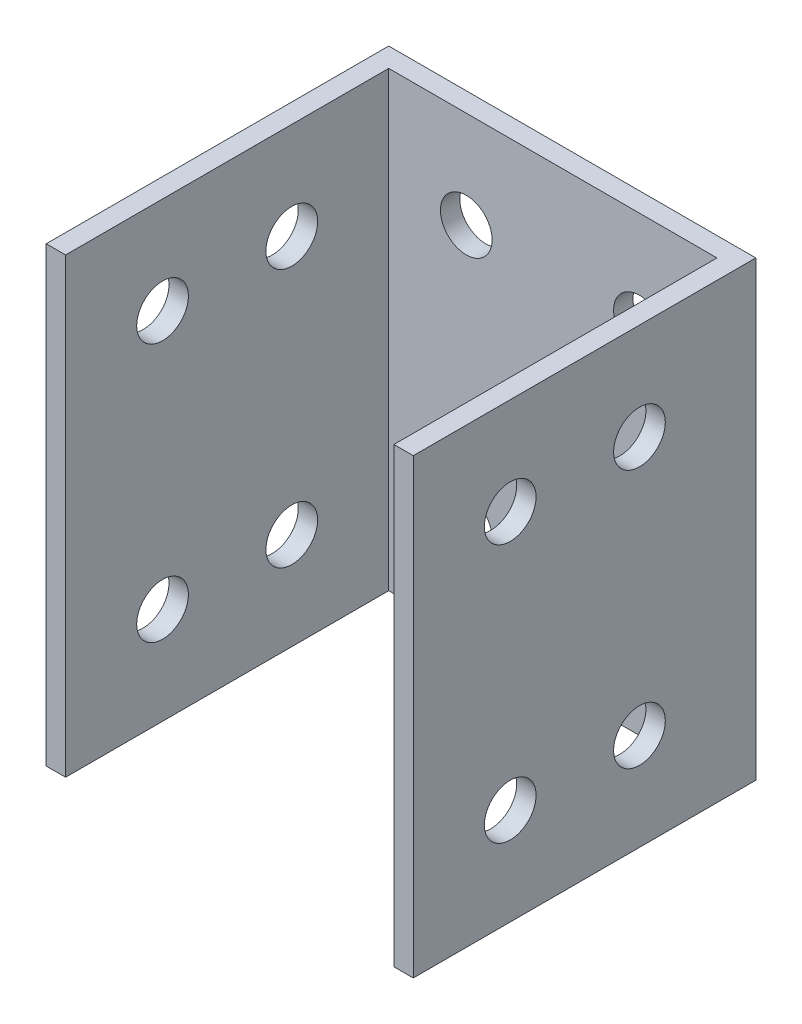
ISO-10303-21;
HEADER;
FILE_DESCRIPTION(('STEP AP214'),'2;1');
FILE_NAME('part.step','',(''),(''),'','','');
FILE_SCHEMA(('AUTOMOTIVE_DESIGN { 1 0 10303 214 1 1 1 1 }'));
ENDSEC;
DATA;
#1=APPLICATION_CONTEXT('core data for automotive mechanical design processes');
#2=APPLICATION_PROTOCOL_DEFINITION('international standard','automotive_design',2000,#1);
#3=PRODUCT_CONTEXT('',#1,'mechanical');
#4=PRODUCT('Part','Part','',(#3));
#5=PRODUCT_RELATED_PRODUCT_CATEGORY('part','',(#4));
#6=PRODUCT_DEFINITION_FORMATION('','',#4);
#7=PRODUCT_DEFINITION_CONTEXT('part definition',#1,'design');
#8=PRODUCT_DEFINITION('design','',#6,#7);
#9=PRODUCT_DEFINITION_SHAPE('','',#8);
#10=(LENGTH_UNIT() NAMED_UNIT(*) SI_UNIT(.MILLI.,.METRE.));
#11=(NAMED_UNIT(*) PLANE_ANGLE_UNIT() SI_UNIT($,.RADIAN.));
#12=(NAMED_UNIT(*) SI_UNIT($,.STERADIAN.) SOLID_ANGLE_UNIT());
#13=UNCERTAINTY_MEASURE_WITH_UNIT(LENGTH_MEASURE(1.E-05),#10,'distance_accuracy_value','');
#14=(GEOMETRIC_REPRESENTATION_CONTEXT(3) GLOBAL_UNCERTAINTY_ASSIGNED_CONTEXT((#13)) GLOBAL_UNIT_ASSIGNED_CONTEXT((#10,
#11,#12)) REPRESENTATION_CONTEXT('',''));
#15=CARTESIAN_POINT('',(0.,0.,0.));
#16=DIRECTION('',(0.,0.,1.));
#17=DIRECTION('',(1.,0.,0.));
#18=AXIS2_PLACEMENT_3D('',#15,#16,#17);
#19=CARTESIAN_POINT('',(-3.,55.,38.));
#20=DIRECTION('',(1.,0.,0.));
#21=DIRECTION('',(0.,0.,-1.));
#22=AXIS2_PLACEMENT_3D('',#19,#20,#21);
#23=CYLINDRICAL_SURFACE('',#22,3.99999999629063);
#24=CARTESIAN_POINT('',(0.,55.,38.));
#25=DIRECTION('',(1.,0.,0.));
#26=DIRECTION('',(0.,0.,-1.));
#27=AXIS2_PLACEMENT_3D('',#24,#25,#26);
#28=CIRCLE('',#27,3.99999999629063);
#29=CARTESIAN_POINT('',(0.,55.,34.0000000037094));
#30=VERTEX_POINT('',#29);
#31=EDGE_CURVE('E101',#30,#30,#28,.T.);
#32=ORIENTED_EDGE('',*,*,#31,.T.);
#33=EDGE_LOOP('',(#32));
#34=FACE_BOUND('',#33,.T.);
#35=CARTESIAN_POINT('',(-3.,55.,38.));
#36=DIRECTION('',(1.,0.,0.));
#37=DIRECTION('',(0.,0.,-1.));
#38=AXIS2_PLACEMENT_3D('',#35,#36,#37);
#39=CIRCLE('',#38,3.99999999629063);
#40=CARTESIAN_POINT('',(-3.,55.,34.0000000037094));
#41=VERTEX_POINT('',#40);
#42=EDGE_CURVE('E128',#41,#41,#39,.F.);
#43=ORIENTED_EDGE('',*,*,#42,.T.);
#44=EDGE_LOOP('',(#43));
#45=FACE_BOUND('',#44,.T.);
#46=ADVANCED_FACE('F25',(#34,#45),#23,.F.);
#47=CARTESIAN_POINT('',(-3.,55.,18.));
#48=DIRECTION('',(1.,0.,0.));
#49=DIRECTION('',(0.,0.,-1.));
#50=AXIS2_PLACEMENT_3D('',#47,#48,#49);
#51=CYLINDRICAL_SURFACE('',#50,3.99999999629063);
#52=CARTESIAN_POINT('',(0.,55.,18.));
#53=DIRECTION('',(1.,0.,0.));
#54=DIRECTION('',(0.,0.,-1.));
#55=AXIS2_PLACEMENT_3D('',#52,#53,#54);
#56=CIRCLE('',#55,3.99999999629063);
#57=CARTESIAN_POINT('',(0.,55.,14.0000000037094));
#58=VERTEX_POINT('',#57);
#59=EDGE_CURVE('E170',#58,#58,#56,.T.);
#60=ORIENTED_EDGE('',*,*,#59,.T.);
#61=EDGE_LOOP('',(#60));
#62=FACE_BOUND('',#61,.T.);
#63=CARTESIAN_POINT('',(-3.,55.,18.));
#64=DIRECTION('',(1.,0.,0.));
#65=DIRECTION('',(0.,0.,-1.));
#66=AXIS2_PLACEMENT_3D('',#63,#64,#65);
#67=CIRCLE('',#66,3.99999999629063);
#68=CARTESIAN_POINT('',(-3.,55.,14.0000000037094));
#69=VERTEX_POINT('',#68);
#70=EDGE_CURVE('E180',#69,#69,#67,.F.);
#71=ORIENTED_EDGE('',*,*,#70,.T.);
#72=EDGE_LOOP('',(#71));
#73=FACE_BOUND('',#72,.T.);
#74=ADVANCED_FACE('F319',(#62,#73),#51,.F.);
#75=CARTESIAN_POINT('',(-3.,15.,38.));
#76=DIRECTION('',(1.,0.,0.));
#77=DIRECTION('',(0.,0.,-1.));
#78=AXIS2_PLACEMENT_3D('',#75,#76,#77);
#79=CYLINDRICAL_SURFACE('',#78,3.99999999629062);
#80=CARTESIAN_POINT('',(0.,15.,38.));
#81=DIRECTION('',(1.,0.,0.));
#82=DIRECTION('',(0.,0.,-1.));
#83=AXIS2_PLACEMENT_3D('',#80,#81,#82);
#84=CIRCLE('',#83,3.99999999629062);
#85=CARTESIAN_POINT('',(0.,15.,34.0000000037094));
#86=VERTEX_POINT('',#85);
#87=EDGE_CURVE('E167',#86,#86,#84,.T.);
#88=ORIENTED_EDGE('',*,*,#87,.T.);
#89=EDGE_LOOP('',(#88));
#90=FACE_BOUND('',#89,.T.);
#91=CARTESIAN_POINT('',(-3.,15.,38.));
#92=DIRECTION('',(1.,0.,0.));
#93=DIRECTION('',(0.,0.,-1.));
#94=AXIS2_PLACEMENT_3D('',#91,#92,#93);
#95=CIRCLE('',#94,3.99999999629062);
#96=CARTESIAN_POINT('',(-3.,15.,34.0000000037094));
#97=VERTEX_POINT('',#96);
#98=EDGE_CURVE('E177',#97,#97,#95,.F.);
#99=ORIENTED_EDGE('',*,*,#98,.T.);
#100=EDGE_LOOP('',(#99));
#101=FACE_BOUND('',#100,.T.);
#102=ADVANCED_FACE('F316',(#90,#101),#79,.F.);
#103=CARTESIAN_POINT('',(-3.,15.,18.));
#104=DIRECTION('',(1.,0.,0.));
#105=DIRECTION('',(0.,0.,-1.));
#106=AXIS2_PLACEMENT_3D('',#103,#104,#105);
#107=CYLINDRICAL_SURFACE('',#106,3.99999999629062);
#108=CARTESIAN_POINT('',(0.,15.,18.));
#109=DIRECTION('',(1.,0.,0.));
#110=DIRECTION('',(0.,0.,-1.));
#111=AXIS2_PLACEMENT_3D('',#108,#109,#110);
#112=CIRCLE('',#111,3.99999999629062);
#113=CARTESIAN_POINT('',(0.,15.,14.0000000037094));
#114=VERTEX_POINT('',#113);
#115=EDGE_CURVE('E122',#114,#114,#112,.T.);
#116=ORIENTED_EDGE('',*,*,#115,.T.);
#117=EDGE_LOOP('',(#116));
#118=FACE_BOUND('',#117,.T.);
#119=CARTESIAN_POINT('',(-3.,15.,18.));
#120=DIRECTION('',(1.,0.,0.));
#121=DIRECTION('',(0.,0.,-1.));
#122=AXIS2_PLACEMENT_3D('',#119,#120,#121);
#123=CIRCLE('',#122,3.99999999629062);
#124=CARTESIAN_POINT('',(-3.,15.,14.0000000037094));
#125=VERTEX_POINT('',#124);
#126=EDGE_CURVE('E125',#125,#125,#123,.F.);
#127=ORIENTED_EDGE('',*,*,#126,.T.);
#128=EDGE_LOOP('',(#127));
#129=FACE_BOUND('',#128,.T.);
#130=ADVANCED_FACE('F312',(#118,#129),#107,.F.);
#131=CARTESIAN_POINT('',(-15.,15.,3.));
#132=DIRECTION('',(0.,0.,-1.));
#133=DIRECTION('',(-1.,0.,0.));
#134=AXIS2_PLACEMENT_3D('',#131,#132,#133);
#135=CYLINDRICAL_SURFACE('',#134,4.00000000294394);
#136=CARTESIAN_POINT('',(-15.,15.,0.));
#137=DIRECTION('',(0.,0.,-1.));
#138=DIRECTION('',(-1.,0.,0.));
#139=AXIS2_PLACEMENT_3D('',#136,#137,#138);
#140=CIRCLE('',#139,4.00000000294394);
#141=CARTESIAN_POINT('',(-19.0000000029439,15.,0.));
#142=VERTEX_POINT('',#141);
#143=EDGE_CURVE('E121',#142,#142,#140,.T.);
#144=ORIENTED_EDGE('',*,*,#143,.T.);
#145=EDGE_LOOP('',(#144));
#146=FACE_BOUND('',#145,.T.);
#147=CARTESIAN_POINT('',(-15.,15.,3.));
#148=DIRECTION('',(0.,0.,-1.));
#149=DIRECTION('',(-1.,0.,0.));
#150=AXIS2_PLACEMENT_3D('',#147,#148,#149);
#151=CIRCLE('',#150,4.00000000294394);
#152=CARTESIAN_POINT('',(-19.0000000029439,15.,3.));
#153=VERTEX_POINT('',#152);
#154=EDGE_CURVE('E28',#153,#153,#151,.F.);
#155=ORIENTED_EDGE('',*,*,#154,.T.);
#156=EDGE_LOOP('',(#155));
#157=FACE_BOUND('',#156,.T.);
#158=ADVANCED_FACE('F196',(#146,#157),#135,.F.);
#159=CARTESIAN_POINT('',(-15.,55.,3.));
#160=DIRECTION('',(0.,0.,-1.));
#161=DIRECTION('',(-1.,0.,0.));
#162=AXIS2_PLACEMENT_3D('',#159,#160,#161);
#163=CYLINDRICAL_SURFACE('',#162,4.00000000294394);
#164=CARTESIAN_POINT('',(-15.,55.,0.));
#165=DIRECTION('',(0.,0.,-1.));
#166=DIRECTION('',(-1.,0.,0.));
#167=AXIS2_PLACEMENT_3D('',#164,#165,#166);
#168=CIRCLE('',#167,4.00000000294394);
#169=CARTESIAN_POINT('',(-19.0000000029439,55.,0.));
#170=VERTEX_POINT('',#169);
#171=EDGE_CURVE('E160',#170,#170,#168,.T.);
#172=ORIENTED_EDGE('',*,*,#171,.T.);
#173=EDGE_LOOP('',(#172));
#174=FACE_BOUND('',#173,.T.);
#175=CARTESIAN_POINT('',(-15.,55.,3.));
#176=DIRECTION('',(0.,0.,-1.));
#177=DIRECTION('',(-1.,0.,0.));
#178=AXIS2_PLACEMENT_3D('',#175,#176,#177);
#179=CIRCLE('',#178,4.00000000294394);
#180=CARTESIAN_POINT('',(-19.0000000029439,55.,3.));
#181=VERTEX_POINT('',#180);
#182=EDGE_CURVE('E189',#181,#181,#179,.F.);
#183=ORIENTED_EDGE('',*,*,#182,.T.);
#184=EDGE_LOOP('',(#183));
#185=FACE_BOUND('',#184,.T.);
#186=ADVANCED_FACE('F305',(#174,#185),#163,.F.);
#187=CARTESIAN_POINT('',(-41.8,15.,3.));
#188=DIRECTION('',(0.,0.,-1.));
#189=DIRECTION('',(-1.,0.,0.));
#190=AXIS2_PLACEMENT_3D('',#187,#188,#189);
#191=CYLINDRICAL_SURFACE('',#190,4.00000000294395);
#192=CARTESIAN_POINT('',(-41.8,15.,0.));
#193=DIRECTION('',(0.,0.,-1.));
#194=DIRECTION('',(-1.,0.,0.));
#195=AXIS2_PLACEMENT_3D('',#192,#193,#194);
#196=CIRCLE('',#195,4.00000000294395);
#197=CARTESIAN_POINT('',(-45.8000000029439,15.,0.));
#198=VERTEX_POINT('',#197);
#199=EDGE_CURVE('E117',#198,#198,#196,.T.);
#200=ORIENTED_EDGE('',*,*,#199,.T.);
#201=EDGE_LOOP('',(#200));
#202=FACE_BOUND('',#201,.T.);
#203=CARTESIAN_POINT('',(-41.8,15.,3.));
#204=DIRECTION('',(0.,0.,-1.));
#205=DIRECTION('',(-1.,0.,0.));
#206=AXIS2_PLACEMENT_3D('',#203,#204,#205);
#207=CIRCLE('',#206,4.00000000294395);
#208=CARTESIAN_POINT('',(-45.8000000029439,15.,3.));
#209=VERTEX_POINT('',#208);
#210=EDGE_CURVE('E187',#209,#209,#207,.F.);
#211=ORIENTED_EDGE('',*,*,#210,.T.);
#212=EDGE_LOOP('',(#211));
#213=FACE_BOUND('',#212,.T.);
#214=ADVANCED_FACE('F301',(#202,#213),#191,.F.);
#215=CARTESIAN_POINT('',(-41.8,55.,3.));
#216=DIRECTION('',(0.,0.,-1.));
#217=DIRECTION('',(-1.,0.,0.));
#218=AXIS2_PLACEMENT_3D('',#215,#216,#217);
#219=CYLINDRICAL_SURFACE('',#218,4.00000000294394);
#220=CARTESIAN_POINT('',(-41.8,55.,0.));
#221=DIRECTION('',(0.,0.,-1.));
#222=DIRECTION('',(-1.,0.,0.));
#223=AXIS2_PLACEMENT_3D('',#220,#221,#222);
#224=CIRCLE('',#223,4.00000000294394);
#225=CARTESIAN_POINT('',(-45.8000000029439,55.,0.));
#226=VERTEX_POINT('',#225);
#227=EDGE_CURVE('E114',#226,#226,#224,.T.);
#228=ORIENTED_EDGE('',*,*,#227,.T.);
#229=EDGE_LOOP('',(#228));
#230=FACE_BOUND('',#229,.T.);
#231=CARTESIAN_POINT('',(-41.8,55.,3.));
#232=DIRECTION('',(0.,0.,-1.));
#233=DIRECTION('',(-1.,0.,0.));
#234=AXIS2_PLACEMENT_3D('',#231,#232,#233);
#235=CIRCLE('',#234,4.00000000294394);
#236=CARTESIAN_POINT('',(-45.8000000029439,55.,3.));
#237=VERTEX_POINT('',#236);
#238=EDGE_CURVE('E129',#237,#237,#235,.F.);
#239=ORIENTED_EDGE('',*,*,#238,.T.);
#240=EDGE_LOOP('',(#239));
#241=FACE_BOUND('',#240,.T.);
#242=ADVANCED_FACE('F202',(#230,#241),#219,.F.);
#243=CARTESIAN_POINT('',(0.,0.,3.));
#244=DIRECTION('',(0.,0.,-1.));
#245=DIRECTION('',(-1.,0.,0.));
#246=AXIS2_PLACEMENT_3D('',#243,#244,#245);
#247=PLANE('',#246);
#248=ORIENTED_EDGE('',*,*,#238,.F.);
#249=EDGE_LOOP('',(#248));
#250=FACE_BOUND('',#249,.T.);
#251=ORIENTED_EDGE('',*,*,#210,.F.);
#252=EDGE_LOOP('',(#251));
#253=FACE_BOUND('',#252,.T.);
#254=ORIENTED_EDGE('',*,*,#182,.F.);
#255=EDGE_LOOP('',(#254));
#256=FACE_BOUND('',#255,.T.);
#257=ORIENTED_EDGE('',*,*,#154,.F.);
#258=EDGE_LOOP('',(#257));
#259=FACE_BOUND('',#258,.T.);
#260=DIRECTION('',(1.,0.,0.));
#261=VECTOR('',#260,1.);
#262=CARTESIAN_POINT('',(0.,0.,3.));
#263=LINE('',#262,#261);
#264=CARTESIAN_POINT('',(-53.8,0.,3.));
#265=VERTEX_POINT('',#264);
#266=CARTESIAN_POINT('',(-3.,0.,3.));
#267=VERTEX_POINT('',#266);
#268=EDGE_CURVE('E207',#265,#267,#263,.T.);
#269=ORIENTED_EDGE('',*,*,#268,.T.);
#270=DIRECTION('',(0.,1.,0.));
#271=VECTOR('',#270,1.);
#272=CARTESIAN_POINT('',(-3.,0.,3.));
#273=LINE('',#272,#271);
#274=CARTESIAN_POINT('',(-3.,70.,3.));
#275=VERTEX_POINT('',#274);
#276=EDGE_CURVE('E126',#267,#275,#273,.T.);
#277=ORIENTED_EDGE('',*,*,#276,.T.);
#278=DIRECTION('',(1.,0.,0.));
#279=VECTOR('',#278,1.);
#280=CARTESIAN_POINT('',(0.,70.,3.));
#281=LINE('',#280,#279);
#282=CARTESIAN_POINT('',(-53.8,70.,3.));
#283=VERTEX_POINT('',#282);
#284=EDGE_CURVE('E227',#275,#283,#281,.F.);
#285=ORIENTED_EDGE('',*,*,#284,.T.);
#286=DIRECTION('',(0.,1.,0.));
#287=VECTOR('',#286,1.);
#288=CARTESIAN_POINT('',(-53.8,0.,3.));
#289=LINE('',#288,#287);
#290=EDGE_CURVE('E156',#283,#265,#289,.F.);
#291=ORIENTED_EDGE('',*,*,#290,.T.);
#292=EDGE_LOOP('',(#269,#277,#285,#291));
#293=FACE_BOUND('',#292,.T.);
#294=ADVANCED_FACE('F198',(#250,#253,#256,#259,#293),#247,.F.);
#295=CARTESIAN_POINT('',(-3.,0.,0.));
#296=DIRECTION('',(1.,0.,0.));
#297=DIRECTION('',(0.,0.,-1.));
#298=AXIS2_PLACEMENT_3D('',#295,#296,#297);
#299=PLANE('',#298);
#300=ORIENTED_EDGE('',*,*,#126,.F.);
#301=EDGE_LOOP('',(#300));
#302=FACE_BOUND('',#301,.T.);
#303=ORIENTED_EDGE('',*,*,#98,.F.);
#304=EDGE_LOOP('',(#303));
#305=FACE_BOUND('',#304,.T.);
#306=ORIENTED_EDGE('',*,*,#70,.F.);
#307=EDGE_LOOP('',(#306));
#308=FACE_BOUND('',#307,.T.);
#309=ORIENTED_EDGE('',*,*,#42,.F.);
#310=EDGE_LOOP('',(#309));
#311=FACE_BOUND('',#310,.T.);
#312=DIRECTION('',(0.,0.,1.));
#313=VECTOR('',#312,1.);
#314=CARTESIAN_POINT('',(-3.,0.,0.));
#315=LINE('',#314,#313);
#316=CARTESIAN_POINT('',(-3.,0.,53.));
#317=VERTEX_POINT('',#316);
#318=EDGE_CURVE('E212',#267,#317,#315,.T.);
#319=ORIENTED_EDGE('',*,*,#318,.T.);
#320=DIRECTION('',(0.,1.,0.));
#321=VECTOR('',#320,1.);
#322=CARTESIAN_POINT('',(-3.,0.,53.));
#323=LINE('',#322,#321);
#324=CARTESIAN_POINT('',(-3.,70.,53.));
#325=VERTEX_POINT('',#324);
#326=EDGE_CURVE('E102',#317,#325,#323,.T.);
#327=ORIENTED_EDGE('',*,*,#326,.T.);
#328=DIRECTION('',(0.,0.,1.));
#329=VECTOR('',#328,1.);
#330=CARTESIAN_POINT('',(-3.,70.,0.));
#331=LINE('',#330,#329);
#332=EDGE_CURVE('E109',#325,#275,#331,.F.);
#333=ORIENTED_EDGE('',*,*,#332,.T.);
#334=ORIENTED_EDGE('',*,*,#276,.F.);
#335=EDGE_LOOP('',(#319,#327,#333,#334));
#336=FACE_BOUND('',#335,.T.);
#337=ADVANCED_FACE('F201',(#302,#305,#308,#311,#336),#299,.F.);
#338=CARTESIAN_POINT('',(0.,0.,53.));
#339=DIRECTION('',(0.,0.,-1.));
#340=DIRECTION('',(-1.,0.,0.));
#341=AXIS2_PLACEMENT_3D('',#338,#339,#340);
#342=PLANE('',#341);
#343=DIRECTION('',(1.,0.,0.));
#344=VECTOR('',#343,1.);
#345=CARTESIAN_POINT('',(0.,0.,53.));
#346=LINE('',#345,#344);
#347=CARTESIAN_POINT('',(0.,0.,53.));
#348=VERTEX_POINT('',#347);
#349=EDGE_CURVE('E97',#317,#348,#346,.T.);
#350=ORIENTED_EDGE('',*,*,#349,.T.);
#351=DIRECTION('',(0.,1.,0.));
#352=VECTOR('',#351,1.);
#353=CARTESIAN_POINT('',(0.,0.,53.));
#354=LINE('',#353,#352);
#355=CARTESIAN_POINT('',(0.,70.,53.));
#356=VERTEX_POINT('',#355);
#357=EDGE_CURVE('E93',#348,#356,#354,.T.);
#358=ORIENTED_EDGE('',*,*,#357,.T.);
#359=DIRECTION('',(1.,0.,0.));
#360=VECTOR('',#359,1.);
#361=CARTESIAN_POINT('',(0.,70.,53.));
#362=LINE('',#361,#360);
#363=EDGE_CURVE('E95',#356,#325,#362,.F.);
#364=ORIENTED_EDGE('',*,*,#363,.T.);
#365=ORIENTED_EDGE('',*,*,#326,.F.);
#366=EDGE_LOOP('',(#350,#358,#364,#365));
#367=FACE_BOUND('',#366,.T.);
#368=ADVANCED_FACE('F94',(#367),#342,.F.);
#369=CARTESIAN_POINT('',(0.,0.,0.));
#370=DIRECTION('',(-1.,0.,0.));
#371=DIRECTION('',(0.,0.,1.));
#372=AXIS2_PLACEMENT_3D('',#369,#370,#371);
#373=PLANE('',#372);
#374=ORIENTED_EDGE('',*,*,#115,.F.);
#375=EDGE_LOOP('',(#374));
#376=FACE_BOUND('',#375,.T.);
#377=ORIENTED_EDGE('',*,*,#87,.F.);
#378=EDGE_LOOP('',(#377));
#379=FACE_BOUND('',#378,.T.);
#380=ORIENTED_EDGE('',*,*,#59,.F.);
#381=EDGE_LOOP('',(#380));
#382=FACE_BOUND('',#381,.T.);
#383=ORIENTED_EDGE('',*,*,#31,.F.);
#384=EDGE_LOOP('',(#383));
#385=FACE_BOUND('',#384,.T.);
#386=DIRECTION('',(0.,0.,1.));
#387=VECTOR('',#386,1.);
#388=CARTESIAN_POINT('',(0.,0.,0.));
#389=LINE('',#388,#387);
#390=CARTESIAN_POINT('',(0.,0.,0.));
#391=VERTEX_POINT('',#390);
#392=EDGE_CURVE('E231',#348,#391,#389,.F.);
#393=ORIENTED_EDGE('',*,*,#392,.T.);
#394=DIRECTION('',(0.,1.,0.));
#395=VECTOR('',#394,1.);
#396=CARTESIAN_POINT('',(0.,0.,0.));
#397=LINE('',#396,#395);
#398=CARTESIAN_POINT('',(0.,70.,0.));
#399=VERTEX_POINT('',#398);
#400=EDGE_CURVE('E112',#391,#399,#397,.T.);
#401=ORIENTED_EDGE('',*,*,#400,.T.);
#402=DIRECTION('',(0.,0.,1.));
#403=VECTOR('',#402,1.);
#404=CARTESIAN_POINT('',(0.,70.,0.));
#405=LINE('',#404,#403);
#406=EDGE_CURVE('E87',#399,#356,#405,.T.);
#407=ORIENTED_EDGE('',*,*,#406,.T.);
#408=ORIENTED_EDGE('',*,*,#357,.F.);
#409=EDGE_LOOP('',(#393,#401,#407,#408));
#410=FACE_BOUND('',#409,.T.);
#411=ADVANCED_FACE('F111',(#376,#379,#382,#385,#410),#373,.F.);
#412=CARTESIAN_POINT('',(0.,0.,0.));
#413=DIRECTION('',(0.,0.,1.));
#414=DIRECTION('',(1.,0.,0.));
#415=AXIS2_PLACEMENT_3D('',#412,#413,#414);
#416=PLANE('',#415);
#417=ORIENTED_EDGE('',*,*,#227,.F.);
#418=EDGE_LOOP('',(#417));
#419=FACE_BOUND('',#418,.T.);
#420=ORIENTED_EDGE('',*,*,#199,.F.);
#421=EDGE_LOOP('',(#420));
#422=FACE_BOUND('',#421,.T.);
#423=ORIENTED_EDGE('',*,*,#171,.F.);
#424=EDGE_LOOP('',(#423));
#425=FACE_BOUND('',#424,.T.);
#426=ORIENTED_EDGE('',*,*,#143,.F.);
#427=EDGE_LOOP('',(#426));
#428=FACE_BOUND('',#427,.T.);
#429=DIRECTION('',(1.,0.,0.));
#430=VECTOR('',#429,1.);
#431=CARTESIAN_POINT('',(0.,0.,0.));
#432=LINE('',#431,#430);
#433=CARTESIAN_POINT('',(-56.8,0.,0.));
#434=VERTEX_POINT('',#433);
#435=EDGE_CURVE('E147',#391,#434,#432,.F.);
#436=ORIENTED_EDGE('',*,*,#435,.T.);
#437=DIRECTION('',(0.,1.,0.));
#438=VECTOR('',#437,1.);
#439=CARTESIAN_POINT('',(-56.8,0.,0.));
#440=LINE('',#439,#438);
#441=CARTESIAN_POINT('',(-56.8,70.,0.));
#442=VERTEX_POINT('',#441);
#443=EDGE_CURVE('E143',#434,#442,#440,.T.);
#444=ORIENTED_EDGE('',*,*,#443,.T.);
#445=DIRECTION('',(1.,0.,0.));
#446=VECTOR('',#445,1.);
#447=CARTESIAN_POINT('',(0.,70.,0.));
#448=LINE('',#447,#446);
#449=EDGE_CURVE('E225',#442,#399,#448,.T.);
#450=ORIENTED_EDGE('',*,*,#449,.T.);
#451=ORIENTED_EDGE('',*,*,#400,.F.);
#452=EDGE_LOOP('',(#436,#444,#450,#451));
#453=FACE_BOUND('',#452,.T.);
#454=ADVANCED_FACE('F286',(#419,#422,#425,#428,#453),#416,.F.);
#455=CARTESIAN_POINT('',(-53.8,15.,18.));
#456=DIRECTION('',(-1.,0.,0.));
#457=DIRECTION('',(0.,0.,1.));
#458=AXIS2_PLACEMENT_3D('',#455,#456,#457);
#459=CYLINDRICAL_SURFACE('',#458,3.99999999629062);
#460=CARTESIAN_POINT('',(-56.8,15.,18.));
#461=DIRECTION('',(-1.,0.,0.));
#462=DIRECTION('',(0.,0.,1.));
#463=AXIS2_PLACEMENT_3D('',#460,#461,#462);
#464=CIRCLE('',#463,3.99999999629062);
#465=CARTESIAN_POINT('',(-56.8,15.,21.9999999962906));
#466=VERTEX_POINT('',#465);
#467=EDGE_CURVE('E140',#466,#466,#464,.T.);
#468=ORIENTED_EDGE('',*,*,#467,.T.);
#469=EDGE_LOOP('',(#468));
#470=FACE_BOUND('',#469,.T.);
#471=CARTESIAN_POINT('',(-53.8,15.,18.));
#472=DIRECTION('',(-1.,0.,0.));
#473=DIRECTION('',(0.,0.,1.));
#474=AXIS2_PLACEMENT_3D('',#471,#472,#473);
#475=CIRCLE('',#474,3.99999999629062);
#476=CARTESIAN_POINT('',(-53.8,15.,21.9999999962906));
#477=VERTEX_POINT('',#476);
#478=EDGE_CURVE('E154',#477,#477,#475,.F.);
#479=ORIENTED_EDGE('',*,*,#478,.T.);
#480=EDGE_LOOP('',(#479));
#481=FACE_BOUND('',#480,.T.);
#482=ADVANCED_FACE('F282',(#470,#481),#459,.F.);
#483=CARTESIAN_POINT('',(-53.8,15.,38.));
#484=DIRECTION('',(-1.,0.,0.));
#485=DIRECTION('',(0.,0.,1.));
#486=AXIS2_PLACEMENT_3D('',#483,#484,#485);
#487=CYLINDRICAL_SURFACE('',#486,3.99999999629062);
#488=CARTESIAN_POINT('',(-56.8,15.,38.));
#489=DIRECTION('',(-1.,0.,0.));
#490=DIRECTION('',(0.,0.,1.));
#491=AXIS2_PLACEMENT_3D('',#488,#489,#490);
#492=CIRCLE('',#491,3.99999999629062);
#493=CARTESIAN_POINT('',(-56.8,15.,41.9999999962906));
#494=VERTEX_POINT('',#493);
#495=EDGE_CURVE('E137',#494,#494,#492,.T.);
#496=ORIENTED_EDGE('',*,*,#495,.T.);
#497=EDGE_LOOP('',(#496));
#498=FACE_BOUND('',#497,.T.);
#499=CARTESIAN_POINT('',(-53.8,15.,38.));
#500=DIRECTION('',(-1.,0.,0.));
#501=DIRECTION('',(0.,0.,1.));
#502=AXIS2_PLACEMENT_3D('',#499,#500,#501);
#503=CIRCLE('',#502,3.99999999629062);
#504=CARTESIAN_POINT('',(-53.8,15.,41.9999999962906));
#505=VERTEX_POINT('',#504);
#506=EDGE_CURVE('E151',#505,#505,#503,.F.);
#507=ORIENTED_EDGE('',*,*,#506,.T.);
#508=EDGE_LOOP('',(#507));
#509=FACE_BOUND('',#508,.T.);
#510=ADVANCED_FACE('F278',(#498,#509),#487,.F.);
#511=CARTESIAN_POINT('',(-53.8,55.,38.));
#512=DIRECTION('',(-1.,0.,0.));
#513=DIRECTION('',(0.,0.,1.));
#514=AXIS2_PLACEMENT_3D('',#511,#512,#513);
#515=CYLINDRICAL_SURFACE('',#514,3.99999999629063);
#516=CARTESIAN_POINT('',(-56.8,55.,38.));
#517=DIRECTION('',(-1.,0.,0.));
#518=DIRECTION('',(0.,0.,1.));
#519=AXIS2_PLACEMENT_3D('',#516,#517,#518);
#520=CIRCLE('',#519,3.99999999629063);
#521=CARTESIAN_POINT('',(-56.8,55.,41.9999999962906));
#522=VERTEX_POINT('',#521);
#523=EDGE_CURVE('E134',#522,#522,#520,.T.);
#524=ORIENTED_EDGE('',*,*,#523,.T.);
#525=EDGE_LOOP('',(#524));
#526=FACE_BOUND('',#525,.T.);
#527=CARTESIAN_POINT('',(-53.8,55.,38.));
#528=DIRECTION('',(-1.,0.,0.));
#529=DIRECTION('',(0.,0.,1.));
#530=AXIS2_PLACEMENT_3D('',#527,#528,#529);
#531=CIRCLE('',#530,3.99999999629063);
#532=CARTESIAN_POINT('',(-53.8,55.,41.9999999962906));
#533=VERTEX_POINT('',#532);
#534=EDGE_CURVE('E148',#533,#533,#531,.F.);
#535=ORIENTED_EDGE('',*,*,#534,.T.);
#536=EDGE_LOOP('',(#535));
#537=FACE_BOUND('',#536,.T.);
#538=ADVANCED_FACE('F274',(#526,#537),#515,.F.);
#539=CARTESIAN_POINT('',(-53.8,55.,18.));
#540=DIRECTION('',(-1.,0.,0.));
#541=DIRECTION('',(0.,0.,1.));
#542=AXIS2_PLACEMENT_3D('',#539,#540,#541);
#543=CYLINDRICAL_SURFACE('',#542,3.99999999629063);
#544=CARTESIAN_POINT('',(-56.8,55.,18.));
#545=DIRECTION('',(-1.,0.,0.));
#546=DIRECTION('',(0.,0.,1.));
#547=AXIS2_PLACEMENT_3D('',#544,#545,#546);
#548=CIRCLE('',#547,3.99999999629063);
#549=CARTESIAN_POINT('',(-56.8,55.,21.9999999962906));
#550=VERTEX_POINT('',#549);
#551=EDGE_CURVE('E130',#550,#550,#548,.T.);
#552=ORIENTED_EDGE('',*,*,#551,.T.);
#553=EDGE_LOOP('',(#552));
#554=FACE_BOUND('',#553,.T.);
#555=CARTESIAN_POINT('',(-53.8,55.,18.));
#556=DIRECTION('',(-1.,0.,0.));
#557=DIRECTION('',(0.,0.,1.));
#558=AXIS2_PLACEMENT_3D('',#555,#556,#557);
#559=CIRCLE('',#558,3.99999999629063);
#560=CARTESIAN_POINT('',(-53.8,55.,21.9999999962906));
#561=VERTEX_POINT('',#560);
#562=EDGE_CURVE('E144',#561,#561,#559,.F.);
#563=ORIENTED_EDGE('',*,*,#562,.T.);
#564=EDGE_LOOP('',(#563));
#565=FACE_BOUND('',#564,.T.);
#566=ADVANCED_FACE('F271',(#554,#565),#543,.F.);
#567=CARTESIAN_POINT('',(0.,70.,0.));
#568=DIRECTION('',(0.,1.,0.));
#569=DIRECTION('',(0.,0.,1.));
#570=AXIS2_PLACEMENT_3D('',#567,#568,#569);
#571=PLANE('',#570);
#572=DIRECTION('',(0.,0.,-1.));
#573=VECTOR('',#572,1.);
#574=CARTESIAN_POINT('',(-56.8,70.,0.));
#575=LINE('',#574,#573);
#576=CARTESIAN_POINT('',(-56.8,70.,53.));
#577=VERTEX_POINT('',#576);
#578=EDGE_CURVE('E232',#442,#577,#575,.F.);
#579=ORIENTED_EDGE('',*,*,#578,.T.);
#580=DIRECTION('',(-1.,0.,0.));
#581=VECTOR('',#580,1.);
#582=CARTESIAN_POINT('',(0.,70.,53.));
#583=LINE('',#582,#581);
#584=CARTESIAN_POINT('',(-53.8,70.,53.));
#585=VERTEX_POINT('',#584);
#586=EDGE_CURVE('E133',#577,#585,#583,.F.);
#587=ORIENTED_EDGE('',*,*,#586,.T.);
#588=DIRECTION('',(0.,0.,1.));
#589=VECTOR('',#588,1.);
#590=CARTESIAN_POINT('',(-53.8,70.,0.));
#591=LINE('',#590,#589);
#592=EDGE_CURVE('E222',#585,#283,#591,.F.);
#593=ORIENTED_EDGE('',*,*,#592,.T.);
#594=ORIENTED_EDGE('',*,*,#284,.F.);
#595=ORIENTED_EDGE('',*,*,#332,.F.);
#596=ORIENTED_EDGE('',*,*,#363,.F.);
#597=ORIENTED_EDGE('',*,*,#406,.F.);
#598=ORIENTED_EDGE('',*,*,#449,.F.);
#599=EDGE_LOOP('',(#579,#587,#593,#594,#595,#596,#597,#598));
#600=FACE_BOUND('',#599,.T.);
#601=ADVANCED_FACE('F106',(#600),#571,.T.);
#602=CARTESIAN_POINT('',(-53.8,0.,0.));
#603=DIRECTION('',(-1.,0.,0.));
#604=DIRECTION('',(0.,0.,1.));
#605=AXIS2_PLACEMENT_3D('',#602,#603,#604);
#606=PLANE('',#605);
#607=ORIENTED_EDGE('',*,*,#562,.F.);
#608=EDGE_LOOP('',(#607));
#609=FACE_BOUND('',#608,.T.);
#610=ORIENTED_EDGE('',*,*,#534,.F.);
#611=EDGE_LOOP('',(#610));
#612=FACE_BOUND('',#611,.T.);
#613=ORIENTED_EDGE('',*,*,#506,.F.);
#614=EDGE_LOOP('',(#613));
#615=FACE_BOUND('',#614,.T.);
#616=ORIENTED_EDGE('',*,*,#478,.F.);
#617=EDGE_LOOP('',(#616));
#618=FACE_BOUND('',#617,.T.);
#619=DIRECTION('',(0.,0.,1.));
#620=VECTOR('',#619,1.);
#621=CARTESIAN_POINT('',(-53.8,0.,0.));
#622=LINE('',#621,#620);
#623=CARTESIAN_POINT('',(-53.8,0.,53.));
#624=VERTEX_POINT('',#623);
#625=EDGE_CURVE('E213',#624,#265,#622,.F.);
#626=ORIENTED_EDGE('',*,*,#625,.T.);
#627=ORIENTED_EDGE('',*,*,#290,.F.);
#628=ORIENTED_EDGE('',*,*,#592,.F.);
#629=DIRECTION('',(0.,1.,0.));
#630=VECTOR('',#629,1.);
#631=CARTESIAN_POINT('',(-53.8,0.,53.));
#632=LINE('',#631,#630);
#633=EDGE_CURVE('E241',#585,#624,#632,.F.);
#634=ORIENTED_EDGE('',*,*,#633,.T.);
#635=EDGE_LOOP('',(#626,#627,#628,#634));
#636=FACE_BOUND('',#635,.T.);
#637=ADVANCED_FACE('F250',(#609,#612,#615,#618,#636),#606,.F.);
#638=CARTESIAN_POINT('',(0.,0.,0.));
#639=DIRECTION('',(0.,1.,0.));
#640=DIRECTION('',(0.,0.,1.));
#641=AXIS2_PLACEMENT_3D('',#638,#639,#640);
#642=PLANE('',#641);
#643=ORIENTED_EDGE('',*,*,#349,.F.);
#644=ORIENTED_EDGE('',*,*,#318,.F.);
#645=ORIENTED_EDGE('',*,*,#268,.F.);
#646=ORIENTED_EDGE('',*,*,#625,.F.);
#647=DIRECTION('',(-1.,0.,0.));
#648=VECTOR('',#647,1.);
#649=CARTESIAN_POINT('',(0.,0.,53.));
#650=LINE('',#649,#648);
#651=CARTESIAN_POINT('',(-56.8,0.,53.));
#652=VERTEX_POINT('',#651);
#653=EDGE_CURVE('E34',#624,#652,#650,.T.);
#654=ORIENTED_EDGE('',*,*,#653,.T.);
#655=DIRECTION('',(0.,0.,-1.));
#656=VECTOR('',#655,1.);
#657=CARTESIAN_POINT('',(-56.8,0.,0.));
#658=LINE('',#657,#656);
#659=EDGE_CURVE('E42',#652,#434,#658,.T.);
#660=ORIENTED_EDGE('',*,*,#659,.T.);
#661=ORIENTED_EDGE('',*,*,#435,.F.);
#662=ORIENTED_EDGE('',*,*,#392,.F.);
#663=EDGE_LOOP('',(#643,#644,#645,#646,#654,#660,#661,#662));
#664=FACE_BOUND('',#663,.T.);
#665=ADVANCED_FACE('F229',(#664),#642,.F.);
#666=CARTESIAN_POINT('',(-56.8,0.,0.));
#667=DIRECTION('',(1.,0.,0.));
#668=DIRECTION('',(0.,0.,-1.));
#669=AXIS2_PLACEMENT_3D('',#666,#667,#668);
#670=PLANE('',#669);
#671=ORIENTED_EDGE('',*,*,#551,.F.);
#672=EDGE_LOOP('',(#671));
#673=FACE_BOUND('',#672,.T.);
#674=ORIENTED_EDGE('',*,*,#523,.F.);
#675=EDGE_LOOP('',(#674));
#676=FACE_BOUND('',#675,.T.);
#677=ORIENTED_EDGE('',*,*,#495,.F.);
#678=EDGE_LOOP('',(#677));
#679=FACE_BOUND('',#678,.T.);
#680=ORIENTED_EDGE('',*,*,#467,.F.);
#681=EDGE_LOOP('',(#680));
#682=FACE_BOUND('',#681,.T.);
#683=ORIENTED_EDGE('',*,*,#659,.F.);
#684=DIRECTION('',(0.,1.,0.));
#685=VECTOR('',#684,1.);
#686=CARTESIAN_POINT('',(-56.8,0.,53.));
#687=LINE('',#686,#685);
#688=EDGE_CURVE('E13',#652,#577,#687,.T.);
#689=ORIENTED_EDGE('',*,*,#688,.T.);
#690=ORIENTED_EDGE('',*,*,#578,.F.);
#691=ORIENTED_EDGE('',*,*,#443,.F.);
#692=EDGE_LOOP('',(#683,#689,#690,#691));
#693=FACE_BOUND('',#692,.T.);
#694=ADVANCED_FACE('F252',(#673,#676,#679,#682,#693),#670,.F.);
#695=CARTESIAN_POINT('',(0.,0.,53.));
#696=DIRECTION('',(0.,0.,-1.));
#697=DIRECTION('',(-1.,0.,0.));
#698=AXIS2_PLACEMENT_3D('',#695,#696,#697);
#699=PLANE('',#698);
#700=ORIENTED_EDGE('',*,*,#653,.F.);
#701=ORIENTED_EDGE('',*,*,#633,.F.);
#702=ORIENTED_EDGE('',*,*,#586,.F.);
#703=ORIENTED_EDGE('',*,*,#688,.F.);
#704=EDGE_LOOP('',(#700,#701,#702,#703));
#705=FACE_BOUND('',#704,.T.);
#706=ADVANCED_FACE('F248',(#705),#699,.F.);
#707=CLOSED_SHELL('',(#46,#74,#102,#130,#158,#186,#214,#242,#294,#337,#368,#411,#454,#482,#510,
#538,#566,#601,#637,#665,#694,#706));
#708=MANIFOLD_SOLID_BREP('B1',#707);
#709=ADVANCED_BREP_SHAPE_REPRESENTATION('',(#18,#708),#14);
#710=SHAPE_DEFINITION_REPRESENTATION(#9,#709);
ENDSEC;
END-ISO-10303-21;
